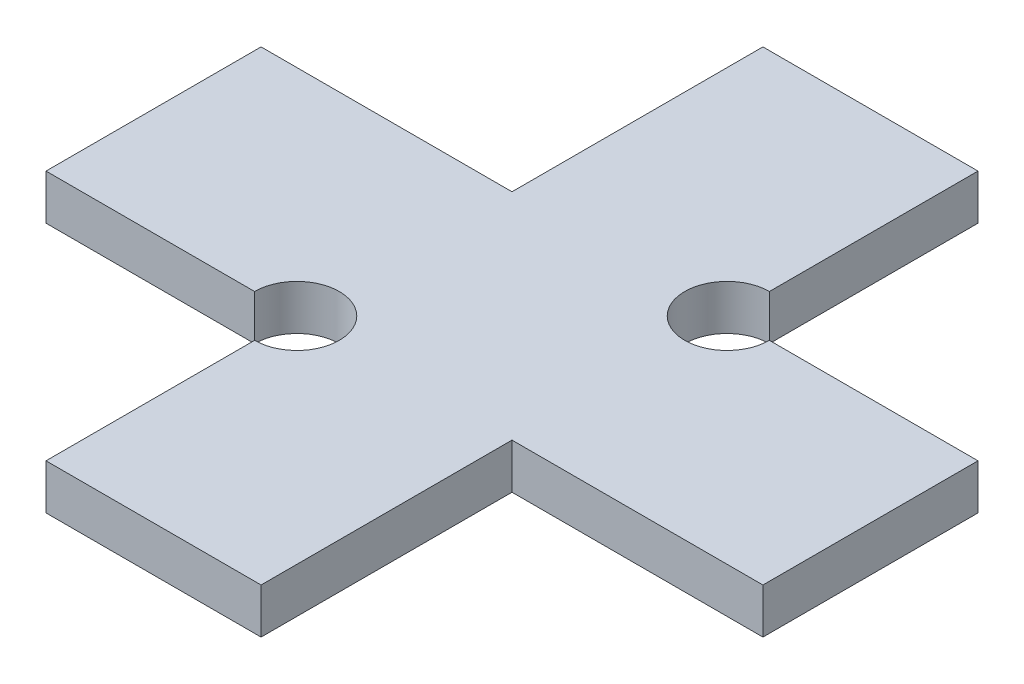
ISO-10303-21;
HEADER;
FILE_DESCRIPTION(('STEP AP214'),'2;1');
FILE_NAME('part.step','',(''),(''),'','','');
FILE_SCHEMA(('AUTOMOTIVE_DESIGN { 1 0 10303 214 1 1 1 1 }'));
ENDSEC;
DATA;
#1=APPLICATION_CONTEXT('core data for automotive mechanical design processes');
#2=APPLICATION_PROTOCOL_DEFINITION('international standard','automotive_design',2000,#1);
#3=PRODUCT_CONTEXT('',#1,'mechanical');
#4=PRODUCT('Part','Part','',(#3));
#5=PRODUCT_RELATED_PRODUCT_CATEGORY('part','',(#4));
#6=PRODUCT_DEFINITION_FORMATION('','',#4);
#7=PRODUCT_DEFINITION_CONTEXT('part definition',#1,'design');
#8=PRODUCT_DEFINITION('design','',#6,#7);
#9=PRODUCT_DEFINITION_SHAPE('','',#8);
#10=(LENGTH_UNIT() NAMED_UNIT(*) SI_UNIT(.MILLI.,.METRE.));
#11=(NAMED_UNIT(*) PLANE_ANGLE_UNIT() SI_UNIT($,.RADIAN.));
#12=(NAMED_UNIT(*) SI_UNIT($,.STERADIAN.) SOLID_ANGLE_UNIT());
#13=UNCERTAINTY_MEASURE_WITH_UNIT(LENGTH_MEASURE(1.E-05),#10,'distance_accuracy_value','');
#14=(GEOMETRIC_REPRESENTATION_CONTEXT(3) GLOBAL_UNCERTAINTY_ASSIGNED_CONTEXT((#13)) GLOBAL_UNIT_ASSIGNED_CONTEXT((#10,
#11,#12)) REPRESENTATION_CONTEXT('',''));
#15=CARTESIAN_POINT('',(0.,0.,0.));
#16=DIRECTION('',(0.,0.,1.));
#17=DIRECTION('',(1.,0.,0.));
#18=AXIS2_PLACEMENT_3D('',#15,#16,#17);
#19=CARTESIAN_POINT('',(-3.81,1.6,3.81));
#20=DIRECTION('',(0.,-1.,0.));
#21=DIRECTION('',(0.,0.,-1.));
#22=AXIS2_PLACEMENT_3D('',#19,#20,#21);
#23=CYLINDRICAL_SURFACE('',#22,1.5);
#24=CARTESIAN_POINT('',(-3.81,0.,3.81));
#25=DIRECTION('',(0.,1.,0.));
#26=DIRECTION('',(0.,0.,1.));
#27=AXIS2_PLACEMENT_3D('',#24,#25,#26);
#28=CIRCLE('',#27,1.5);
#29=CARTESIAN_POINT('',(-3.81,0.,5.31));
#30=VERTEX_POINT('',#29);
#31=CARTESIAN_POINT('',(-5.31,0.,3.81));
#32=VERTEX_POINT('',#31);
#33=EDGE_CURVE('E160',#30,#32,#28,.T.);
#34=ORIENTED_EDGE('',*,*,#33,.F.);
#35=DIRECTION('',(0.,-1.,0.));
#36=VECTOR('',#35,1.);
#37=CARTESIAN_POINT('',(-3.81,1.6,5.31));
#38=LINE('',#37,#36);
#39=CARTESIAN_POINT('',(-3.81,1.6,5.31));
#40=VERTEX_POINT('',#39);
#41=EDGE_CURVE('E11',#40,#30,#38,.T.);
#42=ORIENTED_EDGE('',*,*,#41,.F.);
#43=CARTESIAN_POINT('',(-3.81,1.6,3.81));
#44=DIRECTION('',(0.,1.,0.));
#45=DIRECTION('',(0.,0.,1.));
#46=AXIS2_PLACEMENT_3D('',#43,#44,#45);
#47=CIRCLE('',#46,1.5);
#48=CARTESIAN_POINT('',(-5.31,1.6,3.81));
#49=VERTEX_POINT('',#48);
#50=EDGE_CURVE('E196',#40,#49,#47,.T.);
#51=ORIENTED_EDGE('',*,*,#50,.T.);
#52=DIRECTION('',(0.,-1.,0.));
#53=VECTOR('',#52,1.);
#54=CARTESIAN_POINT('',(-5.31,1.6,3.81));
#55=LINE('',#54,#53);
#56=EDGE_CURVE('E48',#49,#32,#55,.T.);
#57=ORIENTED_EDGE('',*,*,#56,.T.);
#58=EDGE_LOOP('',(#34,#42,#51,#57));
#59=FACE_BOUND('',#58,.T.);
#60=ADVANCED_FACE('F32',(#59),#23,.F.);
#61=CARTESIAN_POINT('',(-3.81,1.6,0.));
#62=DIRECTION('',(-1.,0.,0.));
#63=DIRECTION('',(0.,0.,1.));
#64=AXIS2_PLACEMENT_3D('',#61,#62,#63);
#65=PLANE('',#64);
#66=DIRECTION('',(0.,0.,-1.));
#67=VECTOR('',#66,1.);
#68=CARTESIAN_POINT('',(-3.81,0.,0.));
#69=LINE('',#68,#67);
#70=CARTESIAN_POINT('',(-3.81,0.,12.7));
#71=VERTEX_POINT('',#70);
#72=EDGE_CURVE('E162',#71,#30,#69,.T.);
#73=ORIENTED_EDGE('',*,*,#72,.F.);
#74=DIRECTION('',(0.,-1.,0.));
#75=VECTOR('',#74,1.);
#76=CARTESIAN_POINT('',(-3.81,1.6,12.7));
#77=LINE('',#76,#75);
#78=CARTESIAN_POINT('',(-3.81,1.6,12.7));
#79=VERTEX_POINT('',#78);
#80=EDGE_CURVE('E40',#79,#71,#77,.T.);
#81=ORIENTED_EDGE('',*,*,#80,.F.);
#82=DIRECTION('',(0.,0.,-1.));
#83=VECTOR('',#82,1.);
#84=CARTESIAN_POINT('',(-3.81,1.6,0.));
#85=LINE('',#84,#83);
#86=EDGE_CURVE('E242',#79,#40,#85,.T.);
#87=ORIENTED_EDGE('',*,*,#86,.T.);
#88=ORIENTED_EDGE('',*,*,#41,.T.);
#89=EDGE_LOOP('',(#73,#81,#87,#88));
#90=FACE_BOUND('',#89,.T.);
#91=ADVANCED_FACE('F227',(#90),#65,.T.);
#92=CARTESIAN_POINT('',(0.,1.6,12.7));
#93=DIRECTION('',(0.,0.,1.));
#94=DIRECTION('',(1.,0.,0.));
#95=AXIS2_PLACEMENT_3D('',#92,#93,#94);
#96=PLANE('',#95);
#97=DIRECTION('',(-1.,0.,0.));
#98=VECTOR('',#97,1.);
#99=CARTESIAN_POINT('',(0.,0.,12.7));
#100=LINE('',#99,#98);
#101=CARTESIAN_POINT('',(3.81,0.,12.7));
#102=VERTEX_POINT('',#101);
#103=EDGE_CURVE('E165',#102,#71,#100,.T.);
#104=ORIENTED_EDGE('',*,*,#103,.F.);
#105=DIRECTION('',(0.,-1.,0.));
#106=VECTOR('',#105,1.);
#107=CARTESIAN_POINT('',(3.81,1.6,12.7));
#108=LINE('',#107,#106);
#109=CARTESIAN_POINT('',(3.81,1.6,12.7));
#110=VERTEX_POINT('',#109);
#111=EDGE_CURVE('E216',#110,#102,#108,.T.);
#112=ORIENTED_EDGE('',*,*,#111,.F.);
#113=DIRECTION('',(-1.,0.,0.));
#114=VECTOR('',#113,1.);
#115=CARTESIAN_POINT('',(0.,1.6,12.7));
#116=LINE('',#115,#114);
#117=EDGE_CURVE('E223',#110,#79,#116,.T.);
#118=ORIENTED_EDGE('',*,*,#117,.T.);
#119=ORIENTED_EDGE('',*,*,#80,.T.);
#120=EDGE_LOOP('',(#104,#112,#118,#119));
#121=FACE_BOUND('',#120,.T.);
#122=ADVANCED_FACE('F221',(#121),#96,.T.);
#123=CARTESIAN_POINT('',(3.81,1.6,0.));
#124=DIRECTION('',(-1.,0.,0.));
#125=DIRECTION('',(0.,0.,1.));
#126=AXIS2_PLACEMENT_3D('',#123,#124,#125);
#127=PLANE('',#126);
#128=DIRECTION('',(0.,0.,-1.));
#129=VECTOR('',#128,1.);
#130=CARTESIAN_POINT('',(3.81,0.,0.));
#131=LINE('',#130,#129);
#132=CARTESIAN_POINT('',(3.81,0.,3.81));
#133=VERTEX_POINT('',#132);
#134=EDGE_CURVE('E168',#102,#133,#131,.T.);
#135=ORIENTED_EDGE('',*,*,#134,.T.);
#136=DIRECTION('',(0.,-1.,0.));
#137=VECTOR('',#136,1.);
#138=CARTESIAN_POINT('',(3.81,1.6,3.81));
#139=LINE('',#138,#137);
#140=CARTESIAN_POINT('',(3.81,1.6,3.81));
#141=VERTEX_POINT('',#140);
#142=EDGE_CURVE('E214',#141,#133,#139,.T.);
#143=ORIENTED_EDGE('',*,*,#142,.F.);
#144=DIRECTION('',(0.,0.,-1.));
#145=VECTOR('',#144,1.);
#146=CARTESIAN_POINT('',(3.81,1.6,0.));
#147=LINE('',#146,#145);
#148=EDGE_CURVE('E238',#110,#141,#147,.T.);
#149=ORIENTED_EDGE('',*,*,#148,.F.);
#150=ORIENTED_EDGE('',*,*,#111,.T.);
#151=EDGE_LOOP('',(#135,#143,#149,#150));
#152=FACE_BOUND('',#151,.T.);
#153=ADVANCED_FACE('F235',(#152),#127,.F.);
#154=CARTESIAN_POINT('',(0.,1.6,3.81));
#155=DIRECTION('',(0.,0.,1.));
#156=DIRECTION('',(1.,0.,0.));
#157=AXIS2_PLACEMENT_3D('',#154,#155,#156);
#158=PLANE('',#157);
#159=DIRECTION('',(-1.,0.,0.));
#160=VECTOR('',#159,1.);
#161=CARTESIAN_POINT('',(0.,0.,3.81));
#162=LINE('',#161,#160);
#163=CARTESIAN_POINT('',(12.7,0.,3.81));
#164=VERTEX_POINT('',#163);
#165=EDGE_CURVE('E171',#164,#133,#162,.T.);
#166=ORIENTED_EDGE('',*,*,#165,.F.);
#167=DIRECTION('',(0.,-1.,0.));
#168=VECTOR('',#167,1.);
#169=CARTESIAN_POINT('',(12.7,1.6,3.81));
#170=LINE('',#169,#168);
#171=CARTESIAN_POINT('',(12.7,1.6,3.81));
#172=VERTEX_POINT('',#171);
#173=EDGE_CURVE('E212',#172,#164,#170,.T.);
#174=ORIENTED_EDGE('',*,*,#173,.F.);
#175=DIRECTION('',(-1.,0.,0.));
#176=VECTOR('',#175,1.);
#177=CARTESIAN_POINT('',(0.,1.6,3.81));
#178=LINE('',#177,#176);
#179=EDGE_CURVE('E240',#172,#141,#178,.T.);
#180=ORIENTED_EDGE('',*,*,#179,.T.);
#181=ORIENTED_EDGE('',*,*,#142,.T.);
#182=EDGE_LOOP('',(#166,#174,#180,#181));
#183=FACE_BOUND('',#182,.T.);
#184=ADVANCED_FACE('F284',(#183),#158,.T.);
#185=CARTESIAN_POINT('',(12.7,1.6,0.));
#186=DIRECTION('',(-1.,0.,0.));
#187=DIRECTION('',(0.,0.,1.));
#188=AXIS2_PLACEMENT_3D('',#185,#186,#187);
#189=PLANE('',#188);
#190=DIRECTION('',(0.,0.,-1.));
#191=VECTOR('',#190,1.);
#192=CARTESIAN_POINT('',(12.7,0.,0.));
#193=LINE('',#192,#191);
#194=CARTESIAN_POINT('',(12.7,0.,-3.81));
#195=VERTEX_POINT('',#194);
#196=EDGE_CURVE('E174',#164,#195,#193,.T.);
#197=ORIENTED_EDGE('',*,*,#196,.T.);
#198=DIRECTION('',(0.,-1.,0.));
#199=VECTOR('',#198,1.);
#200=CARTESIAN_POINT('',(12.7,1.6,-3.81));
#201=LINE('',#200,#199);
#202=CARTESIAN_POINT('',(12.7,1.6,-3.81));
#203=VERTEX_POINT('',#202);
#204=EDGE_CURVE('E209',#203,#195,#201,.T.);
#205=ORIENTED_EDGE('',*,*,#204,.F.);
#206=DIRECTION('',(0.,0.,-1.));
#207=VECTOR('',#206,1.);
#208=CARTESIAN_POINT('',(12.7,1.6,0.));
#209=LINE('',#208,#207);
#210=EDGE_CURVE('E248',#172,#203,#209,.T.);
#211=ORIENTED_EDGE('',*,*,#210,.F.);
#212=ORIENTED_EDGE('',*,*,#173,.T.);
#213=EDGE_LOOP('',(#197,#205,#211,#212));
#214=FACE_BOUND('',#213,.T.);
#215=ADVANCED_FACE('F287',(#214),#189,.F.);
#216=CARTESIAN_POINT('',(0.,1.6,-3.81));
#217=DIRECTION('',(0.,0.,1.));
#218=DIRECTION('',(1.,0.,0.));
#219=AXIS2_PLACEMENT_3D('',#216,#217,#218);
#220=PLANE('',#219);
#221=DIRECTION('',(-1.,0.,0.));
#222=VECTOR('',#221,1.);
#223=CARTESIAN_POINT('',(0.,0.,-3.81));
#224=LINE('',#223,#222);
#225=CARTESIAN_POINT('',(5.31,0.,-3.81));
#226=VERTEX_POINT('',#225);
#227=EDGE_CURVE('E176',#195,#226,#224,.T.);
#228=ORIENTED_EDGE('',*,*,#227,.T.);
#229=DIRECTION('',(0.,-1.,0.));
#230=VECTOR('',#229,1.);
#231=CARTESIAN_POINT('',(5.31,1.6,-3.81));
#232=LINE('',#231,#230);
#233=CARTESIAN_POINT('',(5.31,1.6,-3.81));
#234=VERTEX_POINT('',#233);
#235=EDGE_CURVE('E207',#234,#226,#232,.T.);
#236=ORIENTED_EDGE('',*,*,#235,.F.);
#237=DIRECTION('',(-1.,0.,0.));
#238=VECTOR('',#237,1.);
#239=CARTESIAN_POINT('',(0.,1.6,-3.81));
#240=LINE('',#239,#238);
#241=EDGE_CURVE('E250',#203,#234,#240,.T.);
#242=ORIENTED_EDGE('',*,*,#241,.F.);
#243=ORIENTED_EDGE('',*,*,#204,.T.);
#244=EDGE_LOOP('',(#228,#236,#242,#243));
#245=FACE_BOUND('',#244,.T.);
#246=ADVANCED_FACE('F291',(#245),#220,.F.);
#247=CARTESIAN_POINT('',(3.81,1.6,-3.81));
#248=DIRECTION('',(0.,-1.,0.));
#249=DIRECTION('',(0.,0.,-1.));
#250=AXIS2_PLACEMENT_3D('',#247,#248,#249);
#251=CYLINDRICAL_SURFACE('',#250,1.5);
#252=CARTESIAN_POINT('',(3.81,0.,-3.81));
#253=DIRECTION('',(0.,1.,0.));
#254=DIRECTION('',(0.,0.,1.));
#255=AXIS2_PLACEMENT_3D('',#252,#253,#254);
#256=CIRCLE('',#255,1.5);
#257=CARTESIAN_POINT('',(3.81,0.,-5.31));
#258=VERTEX_POINT('',#257);
#259=EDGE_CURVE('E179',#258,#226,#256,.T.);
#260=ORIENTED_EDGE('',*,*,#259,.F.);
#261=DIRECTION('',(0.,-1.,0.));
#262=VECTOR('',#261,1.);
#263=CARTESIAN_POINT('',(3.81,1.6,-5.31));
#264=LINE('',#263,#262);
#265=CARTESIAN_POINT('',(3.81,1.6,-5.31));
#266=VERTEX_POINT('',#265);
#267=EDGE_CURVE('E205',#266,#258,#264,.T.);
#268=ORIENTED_EDGE('',*,*,#267,.F.);
#269=CARTESIAN_POINT('',(3.81,1.6,-3.81));
#270=DIRECTION('',(0.,1.,0.));
#271=DIRECTION('',(0.,0.,1.));
#272=AXIS2_PLACEMENT_3D('',#269,#270,#271);
#273=CIRCLE('',#272,1.5);
#274=EDGE_CURVE('E252',#266,#234,#273,.T.);
#275=ORIENTED_EDGE('',*,*,#274,.T.);
#276=ORIENTED_EDGE('',*,*,#235,.T.);
#277=EDGE_LOOP('',(#260,#268,#275,#276));
#278=FACE_BOUND('',#277,.T.);
#279=ADVANCED_FACE('F295',(#278),#251,.F.);
#280=CARTESIAN_POINT('',(3.81,1.6,0.));
#281=DIRECTION('',(-1.,0.,0.));
#282=DIRECTION('',(0.,0.,1.));
#283=AXIS2_PLACEMENT_3D('',#280,#281,#282);
#284=PLANE('',#283);
#285=DIRECTION('',(0.,0.,-1.));
#286=VECTOR('',#285,1.);
#287=CARTESIAN_POINT('',(3.81,0.,0.));
#288=LINE('',#287,#286);
#289=CARTESIAN_POINT('',(3.81,0.,-12.7));
#290=VERTEX_POINT('',#289);
#291=EDGE_CURVE('E182',#258,#290,#288,.T.);
#292=ORIENTED_EDGE('',*,*,#291,.T.);
#293=DIRECTION('',(0.,-1.,0.));
#294=VECTOR('',#293,1.);
#295=CARTESIAN_POINT('',(3.81,1.6,-12.7));
#296=LINE('',#295,#294);
#297=CARTESIAN_POINT('',(3.81,1.6,-12.7));
#298=VERTEX_POINT('',#297);
#299=EDGE_CURVE('E202',#298,#290,#296,.T.);
#300=ORIENTED_EDGE('',*,*,#299,.F.);
#301=DIRECTION('',(0.,0.,-1.));
#302=VECTOR('',#301,1.);
#303=CARTESIAN_POINT('',(3.81,1.6,0.));
#304=LINE('',#303,#302);
#305=EDGE_CURVE('E255',#266,#298,#304,.T.);
#306=ORIENTED_EDGE('',*,*,#305,.F.);
#307=ORIENTED_EDGE('',*,*,#267,.T.);
#308=EDGE_LOOP('',(#292,#300,#306,#307));
#309=FACE_BOUND('',#308,.T.);
#310=ADVANCED_FACE('F299',(#309),#284,.F.);
#311=CARTESIAN_POINT('',(0.,1.6,-12.7));
#312=DIRECTION('',(0.,0.,1.));
#313=DIRECTION('',(1.,0.,0.));
#314=AXIS2_PLACEMENT_3D('',#311,#312,#313);
#315=PLANE('',#314);
#316=DIRECTION('',(-1.,0.,0.));
#317=VECTOR('',#316,1.);
#318=CARTESIAN_POINT('',(0.,0.,-12.7));
#319=LINE('',#318,#317);
#320=CARTESIAN_POINT('',(-3.81,0.,-12.7));
#321=VERTEX_POINT('',#320);
#322=EDGE_CURVE('E184',#290,#321,#319,.T.);
#323=ORIENTED_EDGE('',*,*,#322,.T.);
#324=DIRECTION('',(0.,-1.,0.));
#325=VECTOR('',#324,1.);
#326=CARTESIAN_POINT('',(-3.81,1.6,-12.7));
#327=LINE('',#326,#325);
#328=CARTESIAN_POINT('',(-3.81,1.6,-12.7));
#329=VERTEX_POINT('',#328);
#330=EDGE_CURVE('E200',#329,#321,#327,.T.);
#331=ORIENTED_EDGE('',*,*,#330,.F.);
#332=DIRECTION('',(-1.,0.,0.));
#333=VECTOR('',#332,1.);
#334=CARTESIAN_POINT('',(0.,1.6,-12.7));
#335=LINE('',#334,#333);
#336=EDGE_CURVE('E257',#298,#329,#335,.T.);
#337=ORIENTED_EDGE('',*,*,#336,.F.);
#338=ORIENTED_EDGE('',*,*,#299,.T.);
#339=EDGE_LOOP('',(#323,#331,#337,#338));
#340=FACE_BOUND('',#339,.T.);
#341=ADVANCED_FACE('F303',(#340),#315,.F.);
#342=CARTESIAN_POINT('',(-3.81,1.6,0.));
#343=DIRECTION('',(-1.,0.,0.));
#344=DIRECTION('',(0.,0.,1.));
#345=AXIS2_PLACEMENT_3D('',#342,#343,#344);
#346=PLANE('',#345);
#347=DIRECTION('',(0.,0.,-1.));
#348=VECTOR('',#347,1.);
#349=CARTESIAN_POINT('',(-3.81,0.,0.));
#350=LINE('',#349,#348);
#351=CARTESIAN_POINT('',(-3.81,0.,-3.81));
#352=VERTEX_POINT('',#351);
#353=EDGE_CURVE('E187',#352,#321,#350,.T.);
#354=ORIENTED_EDGE('',*,*,#353,.F.);
#355=DIRECTION('',(0.,-1.,0.));
#356=VECTOR('',#355,1.);
#357=CARTESIAN_POINT('',(-3.81,1.6,-3.81));
#358=LINE('',#357,#356);
#359=CARTESIAN_POINT('',(-3.81,1.6,-3.81));
#360=VERTEX_POINT('',#359);
#361=EDGE_CURVE('E152',#360,#352,#358,.T.);
#362=ORIENTED_EDGE('',*,*,#361,.F.);
#363=DIRECTION('',(0.,0.,-1.));
#364=VECTOR('',#363,1.);
#365=CARTESIAN_POINT('',(-3.81,1.6,0.));
#366=LINE('',#365,#364);
#367=EDGE_CURVE('E142',#360,#329,#366,.T.);
#368=ORIENTED_EDGE('',*,*,#367,.T.);
#369=ORIENTED_EDGE('',*,*,#330,.T.);
#370=EDGE_LOOP('',(#354,#362,#368,#369));
#371=FACE_BOUND('',#370,.T.);
#372=ADVANCED_FACE('F260',(#371),#346,.T.);
#373=CARTESIAN_POINT('',(0.,1.6,-3.81));
#374=DIRECTION('',(0.,0.,1.));
#375=DIRECTION('',(1.,0.,0.));
#376=AXIS2_PLACEMENT_3D('',#373,#374,#375);
#377=PLANE('',#376);
#378=DIRECTION('',(-1.,0.,0.));
#379=VECTOR('',#378,1.);
#380=CARTESIAN_POINT('',(0.,0.,-3.81));
#381=LINE('',#380,#379);
#382=CARTESIAN_POINT('',(-12.7,0.,-3.81));
#383=VERTEX_POINT('',#382);
#384=EDGE_CURVE('E149',#352,#383,#381,.T.);
#385=ORIENTED_EDGE('',*,*,#384,.T.);
#386=DIRECTION('',(0.,-1.,0.));
#387=VECTOR('',#386,1.);
#388=CARTESIAN_POINT('',(-12.7,1.6,-3.81));
#389=LINE('',#388,#387);
#390=CARTESIAN_POINT('',(-12.7,1.6,-3.81));
#391=VERTEX_POINT('',#390);
#392=EDGE_CURVE('E146',#391,#383,#389,.T.);
#393=ORIENTED_EDGE('',*,*,#392,.F.);
#394=DIRECTION('',(-1.,0.,0.));
#395=VECTOR('',#394,1.);
#396=CARTESIAN_POINT('',(0.,1.6,-3.81));
#397=LINE('',#396,#395);
#398=EDGE_CURVE('E135',#360,#391,#397,.T.);
#399=ORIENTED_EDGE('',*,*,#398,.F.);
#400=ORIENTED_EDGE('',*,*,#361,.T.);
#401=EDGE_LOOP('',(#385,#393,#399,#400));
#402=FACE_BOUND('',#401,.T.);
#403=ADVANCED_FACE('F147',(#402),#377,.F.);
#404=CARTESIAN_POINT('',(-12.7,1.6,0.));
#405=DIRECTION('',(-1.,0.,0.));
#406=DIRECTION('',(0.,0.,1.));
#407=AXIS2_PLACEMENT_3D('',#404,#405,#406);
#408=PLANE('',#407);
#409=DIRECTION('',(0.,0.,-1.));
#410=VECTOR('',#409,1.);
#411=CARTESIAN_POINT('',(-12.7,0.,0.));
#412=LINE('',#411,#410);
#413=CARTESIAN_POINT('',(-12.7,0.,3.81));
#414=VERTEX_POINT('',#413);
#415=EDGE_CURVE('E191',#414,#383,#412,.T.);
#416=ORIENTED_EDGE('',*,*,#415,.F.);
#417=DIRECTION('',(0.,-1.,0.));
#418=VECTOR('',#417,1.);
#419=CARTESIAN_POINT('',(-12.7,1.6,3.81));
#420=LINE('',#419,#418);
#421=CARTESIAN_POINT('',(-12.7,1.6,3.81));
#422=VERTEX_POINT('',#421);
#423=EDGE_CURVE('E91',#422,#414,#420,.T.);
#424=ORIENTED_EDGE('',*,*,#423,.F.);
#425=DIRECTION('',(0.,0.,-1.));
#426=VECTOR('',#425,1.);
#427=CARTESIAN_POINT('',(-12.7,1.6,0.));
#428=LINE('',#427,#426);
#429=EDGE_CURVE('E140',#422,#391,#428,.T.);
#430=ORIENTED_EDGE('',*,*,#429,.T.);
#431=ORIENTED_EDGE('',*,*,#392,.T.);
#432=EDGE_LOOP('',(#416,#424,#430,#431));
#433=FACE_BOUND('',#432,.T.);
#434=ADVANCED_FACE('F154',(#433),#408,.T.);
#435=CARTESIAN_POINT('',(0.,1.6,3.81));
#436=DIRECTION('',(0.,0.,1.));
#437=DIRECTION('',(1.,0.,0.));
#438=AXIS2_PLACEMENT_3D('',#435,#436,#437);
#439=PLANE('',#438);
#440=DIRECTION('',(-1.,0.,0.));
#441=VECTOR('',#440,1.);
#442=CARTESIAN_POINT('',(0.,0.,3.81));
#443=LINE('',#442,#441);
#444=EDGE_CURVE('E193',#32,#414,#443,.T.);
#445=ORIENTED_EDGE('',*,*,#444,.F.);
#446=ORIENTED_EDGE('',*,*,#56,.F.);
#447=DIRECTION('',(-1.,0.,0.));
#448=VECTOR('',#447,1.);
#449=CARTESIAN_POINT('',(0.,1.6,3.81));
#450=LINE('',#449,#448);
#451=EDGE_CURVE('E155',#49,#422,#450,.T.);
#452=ORIENTED_EDGE('',*,*,#451,.T.);
#453=ORIENTED_EDGE('',*,*,#423,.T.);
#454=EDGE_LOOP('',(#445,#446,#452,#453));
#455=FACE_BOUND('',#454,.T.);
#456=ADVANCED_FACE('F263',(#455),#439,.T.);
#457=CARTESIAN_POINT('',(0.,1.6,0.));
#458=DIRECTION('',(0.,1.,0.));
#459=DIRECTION('',(0.,0.,1.));
#460=AXIS2_PLACEMENT_3D('',#457,#458,#459);
#461=PLANE('',#460);
#462=ORIENTED_EDGE('',*,*,#50,.F.);
#463=ORIENTED_EDGE('',*,*,#86,.F.);
#464=ORIENTED_EDGE('',*,*,#117,.F.);
#465=ORIENTED_EDGE('',*,*,#148,.T.);
#466=ORIENTED_EDGE('',*,*,#179,.F.);
#467=ORIENTED_EDGE('',*,*,#210,.T.);
#468=ORIENTED_EDGE('',*,*,#241,.T.);
#469=ORIENTED_EDGE('',*,*,#274,.F.);
#470=ORIENTED_EDGE('',*,*,#305,.T.);
#471=ORIENTED_EDGE('',*,*,#336,.T.);
#472=ORIENTED_EDGE('',*,*,#367,.F.);
#473=ORIENTED_EDGE('',*,*,#398,.T.);
#474=ORIENTED_EDGE('',*,*,#429,.F.);
#475=ORIENTED_EDGE('',*,*,#451,.F.);
#476=EDGE_LOOP('',(#462,#463,#464,#465,#466,#467,#468,#469,#470,#471,#472,#473,#474,#475));
#477=FACE_BOUND('',#476,.T.);
#478=ADVANCED_FACE('F137',(#477),#461,.T.);
#479=CARTESIAN_POINT('',(0.,0.,0.));
#480=DIRECTION('',(0.,1.,0.));
#481=DIRECTION('',(0.,0.,1.));
#482=AXIS2_PLACEMENT_3D('',#479,#480,#481);
#483=PLANE('',#482);
#484=ORIENTED_EDGE('',*,*,#33,.T.);
#485=ORIENTED_EDGE('',*,*,#444,.T.);
#486=ORIENTED_EDGE('',*,*,#415,.T.);
#487=ORIENTED_EDGE('',*,*,#384,.F.);
#488=ORIENTED_EDGE('',*,*,#353,.T.);
#489=ORIENTED_EDGE('',*,*,#322,.F.);
#490=ORIENTED_EDGE('',*,*,#291,.F.);
#491=ORIENTED_EDGE('',*,*,#259,.T.);
#492=ORIENTED_EDGE('',*,*,#227,.F.);
#493=ORIENTED_EDGE('',*,*,#196,.F.);
#494=ORIENTED_EDGE('',*,*,#165,.T.);
#495=ORIENTED_EDGE('',*,*,#134,.F.);
#496=ORIENTED_EDGE('',*,*,#103,.T.);
#497=ORIENTED_EDGE('',*,*,#72,.T.);
#498=EDGE_LOOP('',(#484,#485,#486,#487,#488,#489,#490,#491,#492,#493,#494,#495,#496,#497));
#499=FACE_BOUND('',#498,.T.);
#500=ADVANCED_FACE('F230',(#499),#483,.F.);
#501=CLOSED_SHELL('',(#60,#91,#122,#153,#184,#215,#246,#279,#310,#341,#372,#403,#434,#456,#478,#500));
#502=MANIFOLD_SOLID_BREP('B2',#501);
#503=ADVANCED_BREP_SHAPE_REPRESENTATION('',(#18,#502),#14);
#504=SHAPE_DEFINITION_REPRESENTATION(#9,#503);
ENDSEC;
END-ISO-10303-21;
